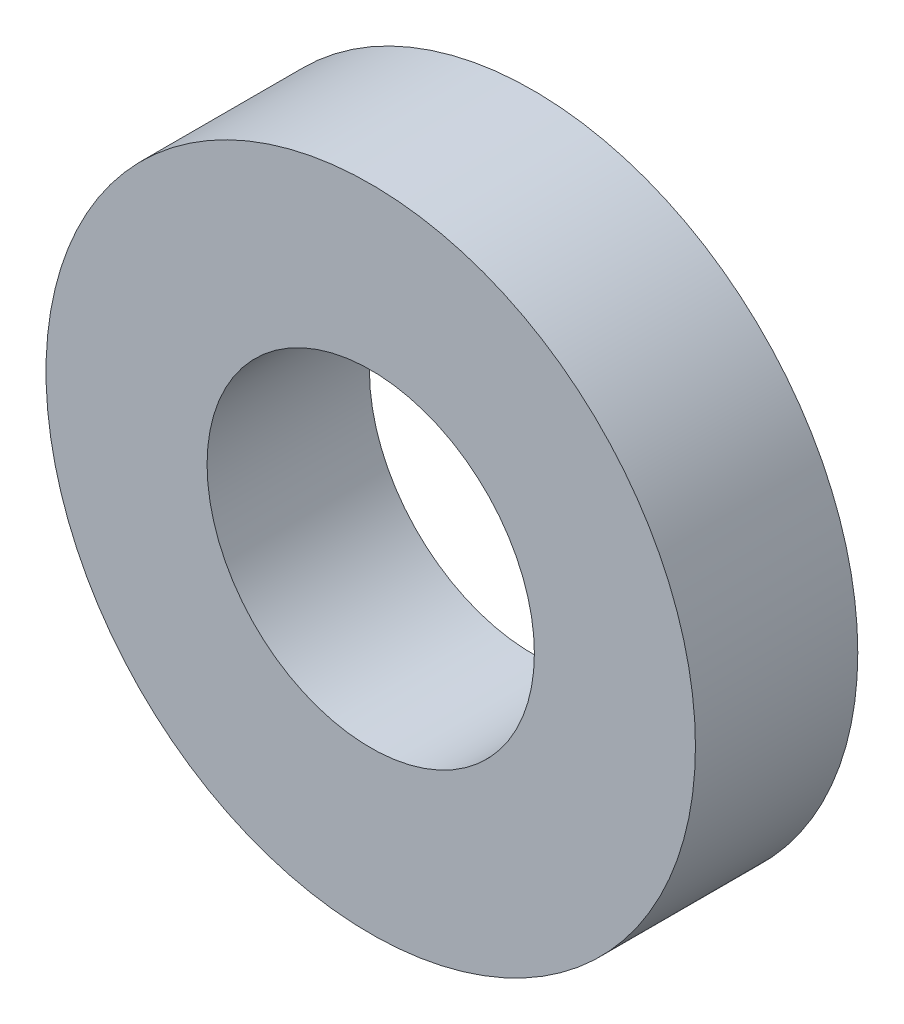
ISO-10303-21;
HEADER;
FILE_DESCRIPTION(('STEP AP214'),'2;1');
FILE_NAME('part.step','',(''),(''),'','','');
FILE_SCHEMA(('AUTOMOTIVE_DESIGN { 1 0 10303 214 1 1 1 1 }'));
ENDSEC;
DATA;
#1=APPLICATION_CONTEXT('core data for automotive mechanical design processes');
#2=APPLICATION_PROTOCOL_DEFINITION('international standard','automotive_design',2000,#1);
#3=PRODUCT_CONTEXT('',#1,'mechanical');
#4=PRODUCT('Part','Part','',(#3));
#5=PRODUCT_RELATED_PRODUCT_CATEGORY('part','',(#4));
#6=PRODUCT_DEFINITION_FORMATION('','',#4);
#7=PRODUCT_DEFINITION_CONTEXT('part definition',#1,'design');
#8=PRODUCT_DEFINITION('design','',#6,#7);
#9=PRODUCT_DEFINITION_SHAPE('','',#8);
#10=(LENGTH_UNIT() NAMED_UNIT(*) SI_UNIT(.MILLI.,.METRE.));
#11=(NAMED_UNIT(*) PLANE_ANGLE_UNIT() SI_UNIT($,.RADIAN.));
#12=(NAMED_UNIT(*) SI_UNIT($,.STERADIAN.) SOLID_ANGLE_UNIT());
#13=UNCERTAINTY_MEASURE_WITH_UNIT(LENGTH_MEASURE(1.E-05),#10,'distance_accuracy_value','');
#14=(GEOMETRIC_REPRESENTATION_CONTEXT(3) GLOBAL_UNCERTAINTY_ASSIGNED_CONTEXT((#13)) GLOBAL_UNIT_ASSIGNED_CONTEXT((#10,
#11,#12)) REPRESENTATION_CONTEXT('',''));
#15=CARTESIAN_POINT('',(0.,0.,0.));
#16=DIRECTION('',(0.,0.,1.));
#17=DIRECTION('',(1.,0.,0.));
#18=AXIS2_PLACEMENT_3D('',#15,#16,#17);
#19=CARTESIAN_POINT('',(0.,0.,1.5875));
#20=DIRECTION('',(0.,0.,1.));
#21=DIRECTION('',(1.,0.,0.));
#22=AXIS2_PLACEMENT_3D('',#19,#20,#21);
#23=PLANE('',#22);
#24=CARTESIAN_POINT('',(0.,0.,1.5875));
#25=DIRECTION('',(0.,0.,1.));
#26=DIRECTION('',(1.,0.,0.));
#27=AXIS2_PLACEMENT_3D('',#24,#25,#26);
#28=CIRCLE('',#27,6.35);
#29=CARTESIAN_POINT('',(6.35,0.,1.5875));
#30=VERTEX_POINT('',#29);
#31=EDGE_CURVE('E12',#30,#30,#28,.T.);
#32=ORIENTED_EDGE('',*,*,#31,.T.);
#33=EDGE_LOOP('',(#32));
#34=FACE_BOUND('',#33,.T.);
#35=CARTESIAN_POINT('',(0.,0.,1.5875));
#36=DIRECTION('',(0.,0.,1.));
#37=DIRECTION('',(1.,0.,0.));
#38=AXIS2_PLACEMENT_3D('',#35,#36,#37);
#39=CIRCLE('',#38,3.2004);
#40=CARTESIAN_POINT('',(3.2004,0.,1.5875));
#41=VERTEX_POINT('',#40);
#42=EDGE_CURVE('E49',#41,#41,#39,.T.);
#43=ORIENTED_EDGE('',*,*,#42,.F.);
#44=EDGE_LOOP('',(#43));
#45=FACE_BOUND('',#44,.T.);
#46=ADVANCED_FACE('F38',(#34,#45),#23,.T.);
#47=CARTESIAN_POINT('',(0.,0.,-1.5875));
#48=DIRECTION('',(0.,0.,1.));
#49=DIRECTION('',(1.,0.,0.));
#50=AXIS2_PLACEMENT_3D('',#47,#48,#49);
#51=PLANE('',#50);
#52=CARTESIAN_POINT('',(0.,0.,-1.5875));
#53=DIRECTION('',(0.,0.,1.));
#54=DIRECTION('',(1.,0.,0.));
#55=AXIS2_PLACEMENT_3D('',#52,#53,#54);
#56=CIRCLE('',#55,6.35);
#57=CARTESIAN_POINT('',(6.35,0.,-1.5875));
#58=VERTEX_POINT('',#57);
#59=EDGE_CURVE('E42',#58,#58,#56,.T.);
#60=ORIENTED_EDGE('',*,*,#59,.F.);
#61=EDGE_LOOP('',(#60));
#62=FACE_BOUND('',#61,.T.);
#63=CARTESIAN_POINT('',(0.,0.,-1.5875));
#64=DIRECTION('',(0.,0.,1.));
#65=DIRECTION('',(1.,0.,0.));
#66=AXIS2_PLACEMENT_3D('',#63,#64,#65);
#67=CIRCLE('',#66,3.2004);
#68=CARTESIAN_POINT('',(3.2004,0.,-1.5875));
#69=VERTEX_POINT('',#68);
#70=EDGE_CURVE('E51',#69,#69,#67,.T.);
#71=ORIENTED_EDGE('',*,*,#70,.T.);
#72=EDGE_LOOP('',(#71));
#73=FACE_BOUND('',#72,.T.);
#74=ADVANCED_FACE('F61',(#62,#73),#51,.F.);
#75=CARTESIAN_POINT('',(0.,0.,1.5875));
#76=DIRECTION('',(0.,0.,-1.));
#77=DIRECTION('',(-1.,0.,0.));
#78=AXIS2_PLACEMENT_3D('',#75,#76,#77);
#79=CYLINDRICAL_SURFACE('',#78,6.35);
#80=ORIENTED_EDGE('',*,*,#31,.F.);
#81=EDGE_LOOP('',(#80));
#82=FACE_BOUND('',#81,.T.);
#83=ORIENTED_EDGE('',*,*,#59,.T.);
#84=EDGE_LOOP('',(#83));
#85=FACE_BOUND('',#84,.T.);
#86=ADVANCED_FACE('F40',(#82,#85),#79,.T.);
#87=CARTESIAN_POINT('',(0.,0.,1.5875));
#88=DIRECTION('',(0.,0.,-1.));
#89=DIRECTION('',(-1.,0.,0.));
#90=AXIS2_PLACEMENT_3D('',#87,#88,#89);
#91=CYLINDRICAL_SURFACE('',#90,3.2004);
#92=ORIENTED_EDGE('',*,*,#42,.T.);
#93=EDGE_LOOP('',(#92));
#94=FACE_BOUND('',#93,.T.);
#95=ORIENTED_EDGE('',*,*,#70,.F.);
#96=EDGE_LOOP('',(#95));
#97=FACE_BOUND('',#96,.T.);
#98=ADVANCED_FACE('F57',(#94,#97),#91,.F.);
#99=CLOSED_SHELL('',(#46,#74,#86,#98));
#100=MANIFOLD_SOLID_BREP('B2',#99);
#101=ADVANCED_BREP_SHAPE_REPRESENTATION('',(#18,#100),#14);
#102=SHAPE_DEFINITION_REPRESENTATION(#9,#101);
ENDSEC;
END-ISO-10303-21;
